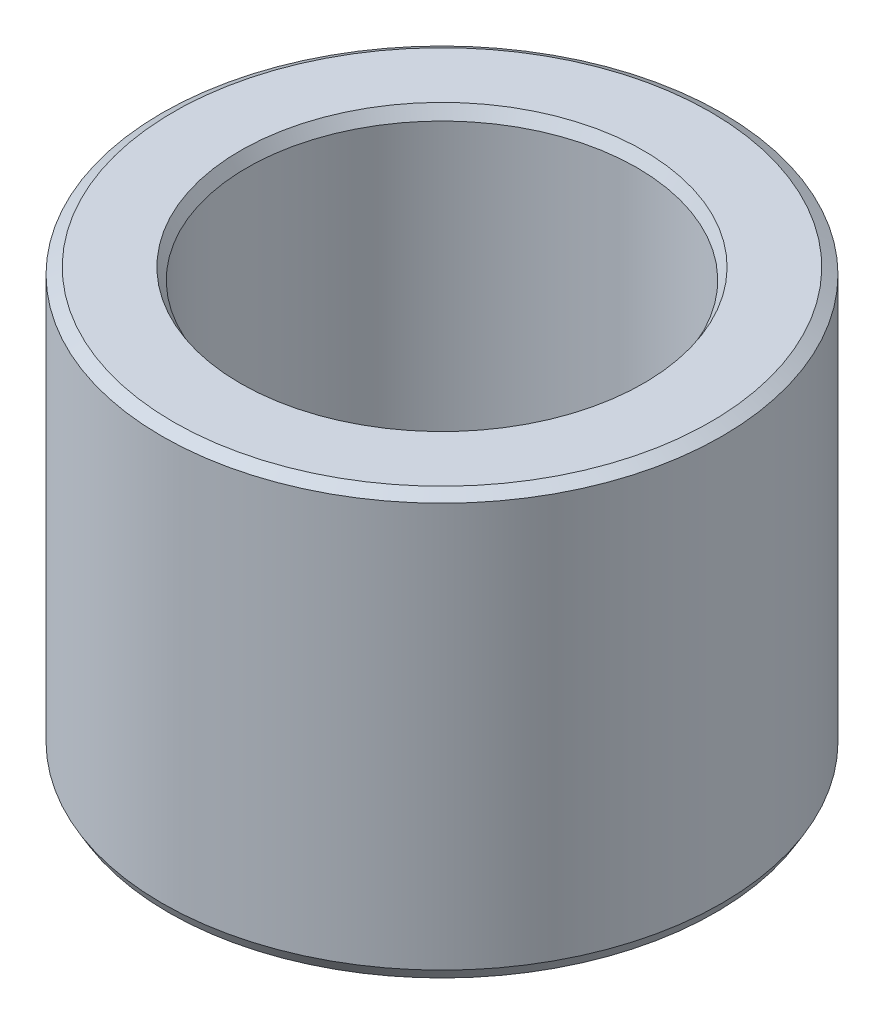
ISO-10303-21;
HEADER;
FILE_DESCRIPTION(('STEP AP214'),'2;1');
FILE_NAME('part.step','',(''),(''),'','','');
FILE_SCHEMA(('AUTOMOTIVE_DESIGN { 1 0 10303 214 1 1 1 1 }'));
ENDSEC;
DATA;
#1=APPLICATION_CONTEXT('core data for automotive mechanical design processes');
#2=APPLICATION_PROTOCOL_DEFINITION('international standard','automotive_design',2000,#1);
#3=PRODUCT_CONTEXT('',#1,'mechanical');
#4=PRODUCT('Part','Part','',(#3));
#5=PRODUCT_RELATED_PRODUCT_CATEGORY('part','',(#4));
#6=PRODUCT_DEFINITION_FORMATION('','',#4);
#7=PRODUCT_DEFINITION_CONTEXT('part definition',#1,'design');
#8=PRODUCT_DEFINITION('design','',#6,#7);
#9=PRODUCT_DEFINITION_SHAPE('','',#8);
#10=(LENGTH_UNIT() NAMED_UNIT(*) SI_UNIT(.MILLI.,.METRE.));
#11=(NAMED_UNIT(*) PLANE_ANGLE_UNIT() SI_UNIT($,.RADIAN.));
#12=(NAMED_UNIT(*) SI_UNIT($,.STERADIAN.) SOLID_ANGLE_UNIT());
#13=UNCERTAINTY_MEASURE_WITH_UNIT(LENGTH_MEASURE(1.E-05),#10,'distance_accuracy_value','');
#14=(GEOMETRIC_REPRESENTATION_CONTEXT(3) GLOBAL_UNCERTAINTY_ASSIGNED_CONTEXT((#13)) GLOBAL_UNIT_ASSIGNED_CONTEXT((#10,
#11,#12)) REPRESENTATION_CONTEXT('',''));
#15=CARTESIAN_POINT('',(0.,0.,0.));
#16=DIRECTION('',(0.,0.,1.));
#17=DIRECTION('',(1.,0.,0.));
#18=AXIS2_PLACEMENT_3D('',#15,#16,#17);
#19=CARTESIAN_POINT('',(0.,86.7514838690244,0.));
#20=DIRECTION('',(0.,-1.,0.));
#21=DIRECTION('',(0.,0.,-1.));
#22=AXIS2_PLACEMENT_3D('',#19,#20,#21);
#23=CYLINDRICAL_SURFACE('',#22,57.5);
#24=CARTESIAN_POINT('',(0.,2.3548019584818,0.));
#25=DIRECTION('',(0.,1.,0.));
#26=DIRECTION('',(0.,0.,1.));
#27=AXIS2_PLACEMENT_3D('',#24,#25,#26);
#28=CIRCLE('',#27,57.5);
#29=CARTESIAN_POINT('',(0.,2.3548019584818,57.5));
#30=VERTEX_POINT('',#29);
#31=EDGE_CURVE('E10',#30,#30,#28,.T.);
#32=ORIENTED_EDGE('',*,*,#31,.T.);
#33=EDGE_LOOP('',(#32));
#34=FACE_BOUND('',#33,.T.);
#35=CARTESIAN_POINT('',(0.,85.3919383244067,0.));
#36=DIRECTION('',(0.,1.,0.));
#37=DIRECTION('',(0.,0.,1.));
#38=AXIS2_PLACEMENT_3D('',#35,#36,#37);
#39=CIRCLE('',#38,57.5);
#40=CARTESIAN_POINT('',(0.,85.3919383244067,57.5));
#41=VERTEX_POINT('',#40);
#42=EDGE_CURVE('E50',#41,#41,#39,.F.);
#43=ORIENTED_EDGE('',*,*,#42,.T.);
#44=EDGE_LOOP('',(#43));
#45=FACE_BOUND('',#44,.T.);
#46=ADVANCED_FACE('F39',(#34,#45),#23,.T.);
#47=CARTESIAN_POINT('',(0.,86.7514838690244,0.));
#48=DIRECTION('',(0.,1.,0.));
#49=DIRECTION('',(0.,0.,1.));
#50=AXIS2_PLACEMENT_3D('',#47,#48,#49);
#51=PLANE('',#50);
#52=CARTESIAN_POINT('',(0.,86.7514838690244,0.));
#53=DIRECTION('',(0.,1.,0.));
#54=DIRECTION('',(0.,0.,1.));
#55=AXIS2_PLACEMENT_3D('',#52,#53,#54);
#56=CIRCLE('',#55,41.4014405130416);
#57=CARTESIAN_POINT('',(0.,86.7514838690244,41.4014405130416));
#58=VERTEX_POINT('',#57);
#59=EDGE_CURVE('E58',#58,#58,#56,.F.);
#60=ORIENTED_EDGE('',*,*,#59,.T.);
#61=EDGE_LOOP('',(#60));
#62=FACE_BOUND('',#61,.T.);
#63=CARTESIAN_POINT('',(0.,86.7514838690244,0.));
#64=DIRECTION('',(0.,1.,0.));
#65=DIRECTION('',(0.,0.,1.));
#66=AXIS2_PLACEMENT_3D('',#63,#64,#65);
#67=CIRCLE('',#66,55.1451980415182);
#68=CARTESIAN_POINT('',(0.,86.7514838690244,55.1451980415182));
#69=VERTEX_POINT('',#68);
#70=EDGE_CURVE('E61',#69,#69,#67,.T.);
#71=ORIENTED_EDGE('',*,*,#70,.T.);
#72=EDGE_LOOP('',(#71));
#73=FACE_BOUND('',#72,.T.);
#74=ADVANCED_FACE('F88',(#62,#73),#51,.T.);
#75=CARTESIAN_POINT('',(0.,0.,0.));
#76=DIRECTION('',(0.,1.,0.));
#77=DIRECTION('',(0.,0.,1.));
#78=AXIS2_PLACEMENT_3D('',#75,#76,#77);
#79=PLANE('',#78);
#80=CARTESIAN_POINT('',(0.,0.,0.));
#81=DIRECTION('',(0.,1.,0.));
#82=DIRECTION('',(0.,0.,1.));
#83=AXIS2_PLACEMENT_3D('',#80,#81,#82);
#84=CIRCLE('',#83,42.3966969269057);
#85=CARTESIAN_POINT('',(0.,0.,42.3966969269057));
#86=VERTEX_POINT('',#85);
#87=EDGE_CURVE('E51',#86,#86,#84,.T.);
#88=ORIENTED_EDGE('',*,*,#87,.T.);
#89=EDGE_LOOP('',(#88));
#90=FACE_BOUND('',#89,.T.);
#91=CARTESIAN_POINT('',(0.,0.,0.));
#92=DIRECTION('',(0.,1.,0.));
#93=DIRECTION('',(0.,0.,1.));
#94=AXIS2_PLACEMENT_3D('',#91,#92,#93);
#95=CIRCLE('',#94,56.1404544553823);
#96=CARTESIAN_POINT('',(0.,0.,56.1404544553823));
#97=VERTEX_POINT('',#96);
#98=EDGE_CURVE('E54',#97,#97,#95,.F.);
#99=ORIENTED_EDGE('',*,*,#98,.T.);
#100=EDGE_LOOP('',(#99));
#101=FACE_BOUND('',#100,.T.);
#102=ADVANCED_FACE('F83',(#90,#101),#79,.F.);
#103=CARTESIAN_POINT('',(0.,86.7514838690244,0.));
#104=DIRECTION('',(0.,-1.,0.));
#105=DIRECTION('',(0.,0.,-1.));
#106=AXIS2_PLACEMENT_3D('',#103,#104,#105);
#107=CYLINDRICAL_SURFACE('',#106,40.0418949684239);
#108=CARTESIAN_POINT('',(0.,84.3966819105427,0.));
#109=DIRECTION('',(0.,1.,0.));
#110=DIRECTION('',(0.,0.,1.));
#111=AXIS2_PLACEMENT_3D('',#108,#109,#110);
#112=CIRCLE('',#111,40.0418949684239);
#113=CARTESIAN_POINT('',(0.,84.3966819105427,40.0418949684239));
#114=VERTEX_POINT('',#113);
#115=EDGE_CURVE('E67',#114,#114,#112,.T.);
#116=ORIENTED_EDGE('',*,*,#115,.T.);
#117=EDGE_LOOP('',(#116));
#118=FACE_BOUND('',#117,.T.);
#119=CARTESIAN_POINT('',(0.,1.35954554461773,0.));
#120=DIRECTION('',(0.,1.,0.));
#121=DIRECTION('',(0.,0.,1.));
#122=AXIS2_PLACEMENT_3D('',#119,#120,#121);
#123=CIRCLE('',#122,40.0418949684239);
#124=CARTESIAN_POINT('',(0.,1.35954554461773,40.0418949684239));
#125=VERTEX_POINT('',#124);
#126=EDGE_CURVE('E69',#125,#125,#123,.F.);
#127=ORIENTED_EDGE('',*,*,#126,.T.);
#128=EDGE_LOOP('',(#127));
#129=FACE_BOUND('',#128,.T.);
#130=ADVANCED_FACE('F71',(#118,#129),#107,.F.);
#131=CARTESIAN_POINT('',(0.,84.3966819105427,0.));
#132=DIRECTION('',(0.,1.,0.));
#133=DIRECTION('',(0.,0.,1.));
#134=AXIS2_PLACEMENT_3D('',#131,#132,#133);
#135=CONICAL_SURFACE('',#134,40.0418949684239,0.523598775598304);
#136=ORIENTED_EDGE('',*,*,#59,.F.);
#137=EDGE_LOOP('',(#136));
#138=FACE_BOUND('',#137,.T.);
#139=ORIENTED_EDGE('',*,*,#115,.F.);
#140=EDGE_LOOP('',(#139));
#141=FACE_BOUND('',#140,.T.);
#142=ADVANCED_FACE('F77',(#138,#141),#135,.F.);
#143=CARTESIAN_POINT('',(0.,0.,0.));
#144=DIRECTION('',(0.,-1.,0.));
#145=DIRECTION('',(0.,0.,-1.));
#146=AXIS2_PLACEMENT_3D('',#143,#144,#145);
#147=CONICAL_SURFACE('',#146,42.3966969269057,1.0471975511966);
#148=ORIENTED_EDGE('',*,*,#126,.F.);
#149=EDGE_LOOP('',(#148));
#150=FACE_BOUND('',#149,.T.);
#151=ORIENTED_EDGE('',*,*,#87,.F.);
#152=EDGE_LOOP('',(#151));
#153=FACE_BOUND('',#152,.T.);
#154=ADVANCED_FACE('F73',(#150,#153),#147,.F.);
#155=CARTESIAN_POINT('',(0.,2.3548019584818,0.));
#156=DIRECTION('',(0.,1.,0.));
#157=DIRECTION('',(0.,0.,1.));
#158=AXIS2_PLACEMENT_3D('',#155,#156,#157);
#159=CONICAL_SURFACE('',#158,57.5,0.523598775598305);
#160=ORIENTED_EDGE('',*,*,#98,.F.);
#161=EDGE_LOOP('',(#160));
#162=FACE_BOUND('',#161,.T.);
#163=ORIENTED_EDGE('',*,*,#31,.F.);
#164=EDGE_LOOP('',(#163));
#165=FACE_BOUND('',#164,.T.);
#166=ADVANCED_FACE('F76',(#162,#165),#159,.T.);
#167=CARTESIAN_POINT('',(0.,86.7514838690244,0.));
#168=DIRECTION('',(0.,-1.,0.));
#169=DIRECTION('',(0.,0.,-1.));
#170=AXIS2_PLACEMENT_3D('',#167,#168,#169);
#171=CONICAL_SURFACE('',#170,55.1451980415182,1.04719755119659);
#172=ORIENTED_EDGE('',*,*,#42,.F.);
#173=EDGE_LOOP('',(#172));
#174=FACE_BOUND('',#173,.T.);
#175=ORIENTED_EDGE('',*,*,#70,.F.);
#176=EDGE_LOOP('',(#175));
#177=FACE_BOUND('',#176,.T.);
#178=ADVANCED_FACE('F45',(#174,#177),#171,.T.);
#179=CLOSED_SHELL('',(#46,#74,#102,#130,#142,#154,#166,#178));
#180=MANIFOLD_SOLID_BREP('B2',#179);
#181=ADVANCED_BREP_SHAPE_REPRESENTATION('',(#18,#180),#14);
#182=SHAPE_DEFINITION_REPRESENTATION(#9,#181);
ENDSEC;
END-ISO-10303-21;
